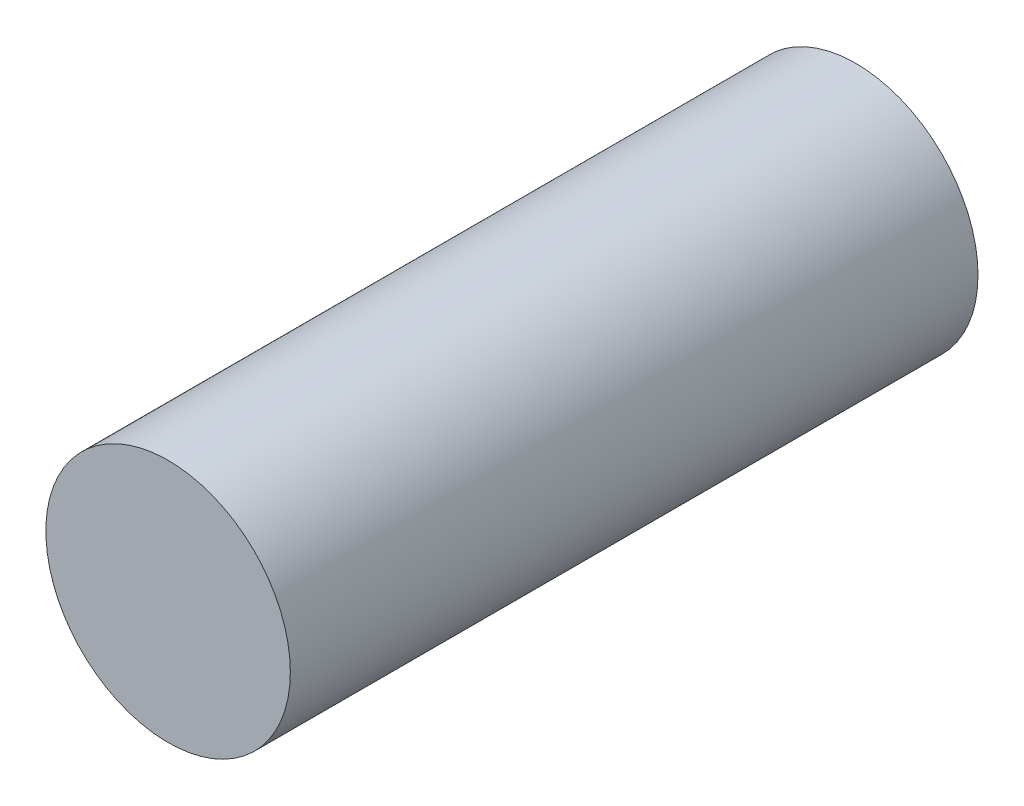
ISO-10303-21;
HEADER;
FILE_DESCRIPTION(('STEP AP214'),'2;1');
FILE_NAME('part.step','',(''),(''),'','','');
FILE_SCHEMA(('AUTOMOTIVE_DESIGN { 1 0 10303 214 1 1 1 1 }'));
ENDSEC;
DATA;
#1=APPLICATION_CONTEXT('core data for automotive mechanical design processes');
#2=APPLICATION_PROTOCOL_DEFINITION('international standard','automotive_design',2000,#1);
#3=PRODUCT_CONTEXT('',#1,'mechanical');
#4=PRODUCT('Part','Part','',(#3));
#5=PRODUCT_RELATED_PRODUCT_CATEGORY('part','',(#4));
#6=PRODUCT_DEFINITION_FORMATION('','',#4);
#7=PRODUCT_DEFINITION_CONTEXT('part definition',#1,'design');
#8=PRODUCT_DEFINITION('design','',#6,#7);
#9=PRODUCT_DEFINITION_SHAPE('','',#8);
#10=(LENGTH_UNIT() NAMED_UNIT(*) SI_UNIT(.MILLI.,.METRE.));
#11=(NAMED_UNIT(*) PLANE_ANGLE_UNIT() SI_UNIT($,.RADIAN.));
#12=(NAMED_UNIT(*) SI_UNIT($,.STERADIAN.) SOLID_ANGLE_UNIT());
#13=UNCERTAINTY_MEASURE_WITH_UNIT(LENGTH_MEASURE(1.E-05),#10,'distance_accuracy_value','');
#14=(GEOMETRIC_REPRESENTATION_CONTEXT(3) GLOBAL_UNCERTAINTY_ASSIGNED_CONTEXT((#13)) GLOBAL_UNIT_ASSIGNED_CONTEXT((#10,
#11,#12)) REPRESENTATION_CONTEXT('',''));
#15=CARTESIAN_POINT('',(0.,0.,0.));
#16=DIRECTION('',(0.,0.,1.));
#17=DIRECTION('',(1.,0.,0.));
#18=AXIS2_PLACEMENT_3D('',#15,#16,#17);
#19=CARTESIAN_POINT('',(25169.5439932217,38791.5203258677,9000.));
#20=DIRECTION('',(0.,0.,-1.));
#21=DIRECTION('',(-1.,0.,0.));
#22=AXIS2_PLACEMENT_3D('',#19,#20,#21);
#23=CYLINDRICAL_SURFACE('',#22,1600.);
#24=CARTESIAN_POINT('',(25169.5439932217,38791.5203258677,9000.));
#25=DIRECTION('',(0.,0.,1.));
#26=DIRECTION('',(1.,0.,0.));
#27=AXIS2_PLACEMENT_3D('',#24,#25,#26);
#28=CIRCLE('',#27,1600.);
#29=CARTESIAN_POINT('',(26769.5439932217,38791.5203258677,9000.));
#30=VERTEX_POINT('',#29);
#31=EDGE_CURVE('E10',#30,#30,#28,.T.);
#32=ORIENTED_EDGE('',*,*,#31,.F.);
#33=EDGE_LOOP('',(#32));
#34=FACE_BOUND('',#33,.T.);
#35=CARTESIAN_POINT('',(25169.5439932217,38791.5203258677,0.));
#36=DIRECTION('',(0.,0.,1.));
#37=DIRECTION('',(1.,0.,0.));
#38=AXIS2_PLACEMENT_3D('',#35,#36,#37);
#39=CIRCLE('',#38,1600.);
#40=CARTESIAN_POINT('',(26769.5439932217,38791.5203258677,0.));
#41=VERTEX_POINT('',#40);
#42=EDGE_CURVE('E32',#41,#41,#39,.T.);
#43=ORIENTED_EDGE('',*,*,#42,.T.);
#44=EDGE_LOOP('',(#43));
#45=FACE_BOUND('',#44,.T.);
#46=ADVANCED_FACE('F29',(#34,#45),#23,.T.);
#47=CARTESIAN_POINT('',(25169.5439932217,38791.5203258677,9000.));
#48=DIRECTION('',(0.,0.,1.));
#49=DIRECTION('',(1.,0.,0.));
#50=AXIS2_PLACEMENT_3D('',#47,#48,#49);
#51=PLANE('',#50);
#52=ORIENTED_EDGE('',*,*,#31,.T.);
#53=EDGE_LOOP('',(#52));
#54=FACE_BOUND('',#53,.T.);
#55=ADVANCED_FACE('F44',(#54),#51,.T.);
#56=CARTESIAN_POINT('',(25169.5439932217,38791.5203258677,0.));
#57=DIRECTION('',(0.,0.,1.));
#58=DIRECTION('',(1.,0.,0.));
#59=AXIS2_PLACEMENT_3D('',#56,#57,#58);
#60=PLANE('',#59);
#61=ORIENTED_EDGE('',*,*,#42,.F.);
#62=EDGE_LOOP('',(#61));
#63=FACE_BOUND('',#62,.T.);
#64=ADVANCED_FACE('F42',(#63),#60,.F.);
#65=CLOSED_SHELL('',(#46,#55,#64));
#66=MANIFOLD_SOLID_BREP('B2',#65);
#67=ADVANCED_BREP_SHAPE_REPRESENTATION('',(#18,#66),#14);
#68=SHAPE_DEFINITION_REPRESENTATION(#9,#67);
ENDSEC;
END-ISO-10303-21;
